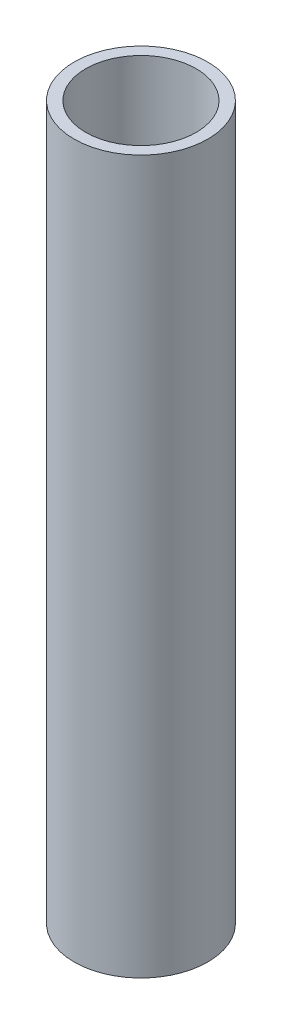
ISO-10303-21;
HEADER;
FILE_DESCRIPTION(('STEP AP214'),'2;1');
FILE_NAME('part.step','',(''),(''),'','','');
FILE_SCHEMA(('AUTOMOTIVE_DESIGN { 1 0 10303 214 1 1 1 1 }'));
ENDSEC;
DATA;
#1=APPLICATION_CONTEXT('core data for automotive mechanical design processes');
#2=APPLICATION_PROTOCOL_DEFINITION('international standard','automotive_design',2000,#1);
#3=PRODUCT_CONTEXT('',#1,'mechanical');
#4=PRODUCT('Part','Part','',(#3));
#5=PRODUCT_RELATED_PRODUCT_CATEGORY('part','',(#4));
#6=PRODUCT_DEFINITION_FORMATION('','',#4);
#7=PRODUCT_DEFINITION_CONTEXT('part definition',#1,'design');
#8=PRODUCT_DEFINITION('design','',#6,#7);
#9=PRODUCT_DEFINITION_SHAPE('','',#8);
#10=(LENGTH_UNIT() NAMED_UNIT(*) SI_UNIT(.MILLI.,.METRE.));
#11=(NAMED_UNIT(*) PLANE_ANGLE_UNIT() SI_UNIT($,.RADIAN.));
#12=(NAMED_UNIT(*) SI_UNIT($,.STERADIAN.) SOLID_ANGLE_UNIT());
#13=UNCERTAINTY_MEASURE_WITH_UNIT(LENGTH_MEASURE(1.E-05),#10,'distance_accuracy_value','');
#14=(GEOMETRIC_REPRESENTATION_CONTEXT(3) GLOBAL_UNCERTAINTY_ASSIGNED_CONTEXT((#13)) GLOBAL_UNIT_ASSIGNED_CONTEXT((#10,
#11,#12)) REPRESENTATION_CONTEXT('',''));
#15=CARTESIAN_POINT('',(0.,0.,0.));
#16=DIRECTION('',(0.,0.,1.));
#17=DIRECTION('',(1.,0.,0.));
#18=AXIS2_PLACEMENT_3D('',#15,#16,#17);
#19=CARTESIAN_POINT('',(0.,0.,0.));
#20=DIRECTION('',(0.,1.,0.));
#21=DIRECTION('',(0.,0.,1.));
#22=AXIS2_PLACEMENT_3D('',#19,#20,#21);
#23=CYLINDRICAL_SURFACE('',#22,9.525);
#24=CARTESIAN_POINT('',(0.,101.6,0.));
#25=DIRECTION('',(0.,1.,0.));
#26=DIRECTION('',(0.,0.,1.));
#27=AXIS2_PLACEMENT_3D('',#24,#25,#26);
#28=CIRCLE('',#27,9.525);
#29=CARTESIAN_POINT('',(0.,101.6,9.525));
#30=VERTEX_POINT('',#29);
#31=EDGE_CURVE('E42',#30,#30,#28,.T.);
#32=ORIENTED_EDGE('',*,*,#31,.F.);
#33=EDGE_LOOP('',(#32));
#34=FACE_BOUND('',#33,.T.);
#35=CARTESIAN_POINT('',(0.,0.,0.));
#36=DIRECTION('',(0.,1.,0.));
#37=DIRECTION('',(0.,0.,1.));
#38=AXIS2_PLACEMENT_3D('',#35,#36,#37);
#39=CIRCLE('',#38,9.525);
#40=CARTESIAN_POINT('',(0.,0.,9.525));
#41=VERTEX_POINT('',#40);
#42=EDGE_CURVE('E33',#41,#41,#39,.T.);
#43=ORIENTED_EDGE('',*,*,#42,.T.);
#44=EDGE_LOOP('',(#43));
#45=FACE_BOUND('',#44,.T.);
#46=ADVANCED_FACE('F30',(#34,#45),#23,.T.);
#47=CARTESIAN_POINT('',(0.,0.,0.));
#48=DIRECTION('',(0.,1.,0.));
#49=DIRECTION('',(0.,0.,1.));
#50=AXIS2_PLACEMENT_3D('',#47,#48,#49);
#51=PLANE('',#50);
#52=CARTESIAN_POINT('',(0.,0.,0.));
#53=DIRECTION('',(0.,1.,0.));
#54=DIRECTION('',(0.,0.,1.));
#55=AXIS2_PLACEMENT_3D('',#52,#53,#54);
#56=CIRCLE('',#55,7.874);
#57=CARTESIAN_POINT('',(0.,0.,7.874));
#58=VERTEX_POINT('',#57);
#59=EDGE_CURVE('E37',#58,#58,#56,.F.);
#60=ORIENTED_EDGE('',*,*,#59,.F.);
#61=EDGE_LOOP('',(#60));
#62=FACE_BOUND('',#61,.T.);
#63=ORIENTED_EDGE('',*,*,#42,.F.);
#64=EDGE_LOOP('',(#63));
#65=FACE_BOUND('',#64,.T.);
#66=ADVANCED_FACE('F51',(#62,#65),#51,.F.);
#67=CARTESIAN_POINT('',(0.,101.6,0.));
#68=DIRECTION('',(0.,1.,0.));
#69=DIRECTION('',(0.,0.,1.));
#70=AXIS2_PLACEMENT_3D('',#67,#68,#69);
#71=PLANE('',#70);
#72=CARTESIAN_POINT('',(0.,101.6,0.));
#73=DIRECTION('',(0.,1.,0.));
#74=DIRECTION('',(0.,0.,1.));
#75=AXIS2_PLACEMENT_3D('',#72,#73,#74);
#76=CIRCLE('',#75,7.874);
#77=CARTESIAN_POINT('',(0.,101.6,7.874));
#78=VERTEX_POINT('',#77);
#79=EDGE_CURVE('E10',#78,#78,#76,.F.);
#80=ORIENTED_EDGE('',*,*,#79,.T.);
#81=EDGE_LOOP('',(#80));
#82=FACE_BOUND('',#81,.T.);
#83=ORIENTED_EDGE('',*,*,#31,.T.);
#84=EDGE_LOOP('',(#83));
#85=FACE_BOUND('',#84,.T.);
#86=ADVANCED_FACE('F53',(#82,#85),#71,.T.);
#87=CARTESIAN_POINT('',(0.,0.,0.));
#88=DIRECTION('',(0.,1.,0.));
#89=DIRECTION('',(0.,0.,1.));
#90=AXIS2_PLACEMENT_3D('',#87,#88,#89);
#91=CYLINDRICAL_SURFACE('',#90,7.874);
#92=ORIENTED_EDGE('',*,*,#79,.F.);
#93=EDGE_LOOP('',(#92));
#94=FACE_BOUND('',#93,.T.);
#95=ORIENTED_EDGE('',*,*,#59,.T.);
#96=EDGE_LOOP('',(#95));
#97=FACE_BOUND('',#96,.T.);
#98=ADVANCED_FACE('F59',(#94,#97),#91,.F.);
#99=CLOSED_SHELL('',(#46,#66,#86,#98));
#100=MANIFOLD_SOLID_BREP('B2',#99);
#101=ADVANCED_BREP_SHAPE_REPRESENTATION('',(#18,#100),#14);
#102=SHAPE_DEFINITION_REPRESENTATION(#9,#101);
ENDSEC;
END-ISO-10303-21;
